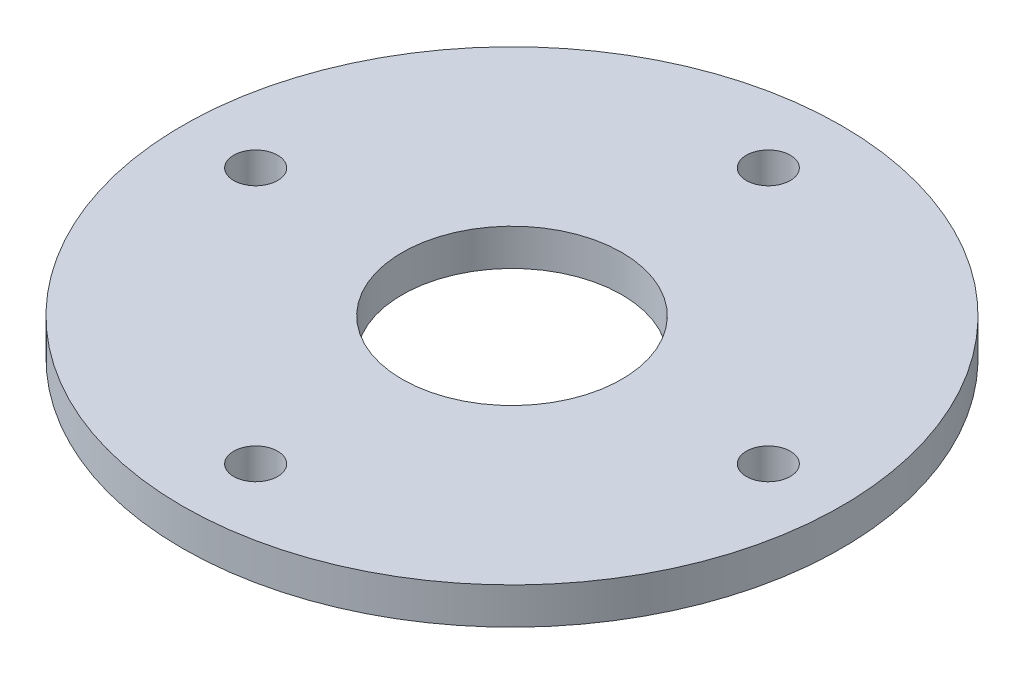
ISO-10303-21;
HEADER;
FILE_DESCRIPTION(('STEP AP214'),'2;1');
FILE_NAME('part.step','',(''),(''),'','','');
FILE_SCHEMA(('AUTOMOTIVE_DESIGN { 1 0 10303 214 1 1 1 1 }'));
ENDSEC;
DATA;
#1=APPLICATION_CONTEXT('core data for automotive mechanical design processes');
#2=APPLICATION_PROTOCOL_DEFINITION('international standard','automotive_design',2000,#1);
#3=PRODUCT_CONTEXT('',#1,'mechanical');
#4=PRODUCT('Part','Part','',(#3));
#5=PRODUCT_RELATED_PRODUCT_CATEGORY('part','',(#4));
#6=PRODUCT_DEFINITION_FORMATION('','',#4);
#7=PRODUCT_DEFINITION_CONTEXT('part definition',#1,'design');
#8=PRODUCT_DEFINITION('design','',#6,#7);
#9=PRODUCT_DEFINITION_SHAPE('','',#8);
#10=(LENGTH_UNIT() NAMED_UNIT(*) SI_UNIT(.MILLI.,.METRE.));
#11=(NAMED_UNIT(*) PLANE_ANGLE_UNIT() SI_UNIT($,.RADIAN.));
#12=(NAMED_UNIT(*) SI_UNIT($,.STERADIAN.) SOLID_ANGLE_UNIT());
#13=UNCERTAINTY_MEASURE_WITH_UNIT(LENGTH_MEASURE(1.E-05),#10,'distance_accuracy_value','');
#14=(GEOMETRIC_REPRESENTATION_CONTEXT(3) GLOBAL_UNCERTAINTY_ASSIGNED_CONTEXT((#13)) GLOBAL_UNIT_ASSIGNED_CONTEXT((#10,
#11,#12)) REPRESENTATION_CONTEXT('',''));
#15=CARTESIAN_POINT('',(0.,0.,0.));
#16=DIRECTION('',(0.,0.,1.));
#17=DIRECTION('',(1.,0.,0.));
#18=AXIS2_PLACEMENT_3D('',#15,#16,#17);
#19=CARTESIAN_POINT('',(0.,5.,0.));
#20=DIRECTION('',(0.,-1.,0.));
#21=DIRECTION('',(0.,0.,-1.));
#22=AXIS2_PLACEMENT_3D('',#19,#20,#21);
#23=CYLINDRICAL_SURFACE('',#22,15.);
#24=CARTESIAN_POINT('',(0.,5.,0.));
#25=DIRECTION('',(0.,1.,0.));
#26=DIRECTION('',(0.,0.,1.));
#27=AXIS2_PLACEMENT_3D('',#24,#25,#26);
#28=CIRCLE('',#27,15.);
#29=CARTESIAN_POINT('',(0.,5.,15.));
#30=VERTEX_POINT('',#29);
#31=EDGE_CURVE('E43',#30,#30,#28,.T.);
#32=ORIENTED_EDGE('',*,*,#31,.T.);
#33=EDGE_LOOP('',(#32));
#34=FACE_BOUND('',#33,.T.);
#35=CARTESIAN_POINT('',(0.,0.,0.));
#36=DIRECTION('',(0.,1.,0.));
#37=DIRECTION('',(0.,0.,1.));
#38=AXIS2_PLACEMENT_3D('',#35,#36,#37);
#39=CIRCLE('',#38,15.);
#40=CARTESIAN_POINT('',(0.,0.,15.));
#41=VERTEX_POINT('',#40);
#42=EDGE_CURVE('E63',#41,#41,#39,.T.);
#43=ORIENTED_EDGE('',*,*,#42,.F.);
#44=EDGE_LOOP('',(#43));
#45=FACE_BOUND('',#44,.T.);
#46=ADVANCED_FACE('F35',(#34,#45),#23,.F.);
#47=CARTESIAN_POINT('',(0.,5.,-35.));
#48=DIRECTION('',(0.,-1.,0.));
#49=DIRECTION('',(0.,0.,-1.));
#50=AXIS2_PLACEMENT_3D('',#47,#48,#49);
#51=CYLINDRICAL_SURFACE('',#50,3.);
#52=CARTESIAN_POINT('',(0.,5.,-35.));
#53=DIRECTION('',(0.,1.,0.));
#54=DIRECTION('',(0.,0.,1.));
#55=AXIS2_PLACEMENT_3D('',#52,#53,#54);
#56=CIRCLE('',#55,3.);
#57=CARTESIAN_POINT('',(0.,5.,-32.));
#58=VERTEX_POINT('',#57);
#59=EDGE_CURVE('E48',#58,#58,#56,.T.);
#60=ORIENTED_EDGE('',*,*,#59,.T.);
#61=EDGE_LOOP('',(#60));
#62=FACE_BOUND('',#61,.T.);
#63=CARTESIAN_POINT('',(0.,0.,-35.));
#64=DIRECTION('',(0.,1.,0.));
#65=DIRECTION('',(0.,0.,1.));
#66=AXIS2_PLACEMENT_3D('',#63,#64,#65);
#67=CIRCLE('',#66,3.);
#68=CARTESIAN_POINT('',(0.,0.,-32.));
#69=VERTEX_POINT('',#68);
#70=EDGE_CURVE('E61',#69,#69,#67,.T.);
#71=ORIENTED_EDGE('',*,*,#70,.F.);
#72=EDGE_LOOP('',(#71));
#73=FACE_BOUND('',#72,.T.);
#74=ADVANCED_FACE('F84',(#62,#73),#51,.F.);
#75=CARTESIAN_POINT('',(0.,5.,35.));
#76=DIRECTION('',(0.,-1.,0.));
#77=DIRECTION('',(0.,0.,-1.));
#78=AXIS2_PLACEMENT_3D('',#75,#76,#77);
#79=CYLINDRICAL_SURFACE('',#78,3.);
#80=CARTESIAN_POINT('',(0.,5.,35.));
#81=DIRECTION('',(0.,1.,0.));
#82=DIRECTION('',(0.,0.,1.));
#83=AXIS2_PLACEMENT_3D('',#80,#81,#82);
#84=CIRCLE('',#83,3.);
#85=CARTESIAN_POINT('',(0.,5.,38.));
#86=VERTEX_POINT('',#85);
#87=EDGE_CURVE('E77',#86,#86,#84,.T.);
#88=ORIENTED_EDGE('',*,*,#87,.T.);
#89=EDGE_LOOP('',(#88));
#90=FACE_BOUND('',#89,.T.);
#91=CARTESIAN_POINT('',(0.,0.,35.));
#92=DIRECTION('',(0.,1.,0.));
#93=DIRECTION('',(0.,0.,1.));
#94=AXIS2_PLACEMENT_3D('',#91,#92,#93);
#95=CIRCLE('',#94,3.);
#96=CARTESIAN_POINT('',(0.,0.,38.));
#97=VERTEX_POINT('',#96);
#98=EDGE_CURVE('E58',#97,#97,#95,.T.);
#99=ORIENTED_EDGE('',*,*,#98,.F.);
#100=EDGE_LOOP('',(#99));
#101=FACE_BOUND('',#100,.T.);
#102=ADVANCED_FACE('F102',(#90,#101),#79,.F.);
#103=CARTESIAN_POINT('',(35.,5.,0.));
#104=DIRECTION('',(0.,-1.,0.));
#105=DIRECTION('',(0.,0.,-1.));
#106=AXIS2_PLACEMENT_3D('',#103,#104,#105);
#107=CYLINDRICAL_SURFACE('',#106,3.);
#108=CARTESIAN_POINT('',(35.,5.,0.));
#109=DIRECTION('',(0.,1.,0.));
#110=DIRECTION('',(0.,0.,1.));
#111=AXIS2_PLACEMENT_3D('',#108,#109,#110);
#112=CIRCLE('',#111,3.);
#113=CARTESIAN_POINT('',(35.,5.,3.));
#114=VERTEX_POINT('',#113);
#115=EDGE_CURVE('E72',#114,#114,#112,.T.);
#116=ORIENTED_EDGE('',*,*,#115,.T.);
#117=EDGE_LOOP('',(#116));
#118=FACE_BOUND('',#117,.T.);
#119=CARTESIAN_POINT('',(35.,0.,0.));
#120=DIRECTION('',(0.,1.,0.));
#121=DIRECTION('',(0.,0.,1.));
#122=AXIS2_PLACEMENT_3D('',#119,#120,#121);
#123=CIRCLE('',#122,3.);
#124=CARTESIAN_POINT('',(35.,0.,3.));
#125=VERTEX_POINT('',#124);
#126=EDGE_CURVE('E55',#125,#125,#123,.T.);
#127=ORIENTED_EDGE('',*,*,#126,.F.);
#128=EDGE_LOOP('',(#127));
#129=FACE_BOUND('',#128,.T.);
#130=ADVANCED_FACE('F108',(#118,#129),#107,.F.);
#131=CARTESIAN_POINT('',(-35.,5.,0.));
#132=DIRECTION('',(0.,-1.,0.));
#133=DIRECTION('',(0.,0.,-1.));
#134=AXIS2_PLACEMENT_3D('',#131,#132,#133);
#135=CYLINDRICAL_SURFACE('',#134,3.);
#136=CARTESIAN_POINT('',(-35.,5.,0.));
#137=DIRECTION('',(0.,1.,0.));
#138=DIRECTION('',(0.,0.,1.));
#139=AXIS2_PLACEMENT_3D('',#136,#137,#138);
#140=CIRCLE('',#139,3.);
#141=CARTESIAN_POINT('',(-35.,5.,3.00000000000002));
#142=VERTEX_POINT('',#141);
#143=EDGE_CURVE('E68',#142,#142,#140,.T.);
#144=ORIENTED_EDGE('',*,*,#143,.T.);
#145=EDGE_LOOP('',(#144));
#146=FACE_BOUND('',#145,.T.);
#147=CARTESIAN_POINT('',(-35.,0.,0.));
#148=DIRECTION('',(0.,1.,0.));
#149=DIRECTION('',(0.,0.,1.));
#150=AXIS2_PLACEMENT_3D('',#147,#148,#149);
#151=CIRCLE('',#150,3.);
#152=CARTESIAN_POINT('',(-35.,0.,3.00000000000002));
#153=VERTEX_POINT('',#152);
#154=EDGE_CURVE('E52',#153,#153,#151,.T.);
#155=ORIENTED_EDGE('',*,*,#154,.F.);
#156=EDGE_LOOP('',(#155));
#157=FACE_BOUND('',#156,.T.);
#158=ADVANCED_FACE('F37',(#146,#157),#135,.F.);
#159=CARTESIAN_POINT('',(0.,5.,0.));
#160=DIRECTION('',(0.,-1.,0.));
#161=DIRECTION('',(0.,0.,-1.));
#162=AXIS2_PLACEMENT_3D('',#159,#160,#161);
#163=CYLINDRICAL_SURFACE('',#162,45.);
#164=CARTESIAN_POINT('',(0.,5.,0.));
#165=DIRECTION('',(0.,1.,0.));
#166=DIRECTION('',(0.,0.,1.));
#167=AXIS2_PLACEMENT_3D('',#164,#165,#166);
#168=CIRCLE('',#167,45.);
#169=CARTESIAN_POINT('',(0.,5.,45.));
#170=VERTEX_POINT('',#169);
#171=EDGE_CURVE('E10',#170,#170,#168,.T.);
#172=ORIENTED_EDGE('',*,*,#171,.F.);
#173=EDGE_LOOP('',(#172));
#174=FACE_BOUND('',#173,.T.);
#175=CARTESIAN_POINT('',(0.,0.,0.));
#176=DIRECTION('',(0.,1.,0.));
#177=DIRECTION('',(0.,0.,1.));
#178=AXIS2_PLACEMENT_3D('',#175,#176,#177);
#179=CIRCLE('',#178,45.);
#180=CARTESIAN_POINT('',(0.,0.,45.));
#181=VERTEX_POINT('',#180);
#182=EDGE_CURVE('E39',#181,#181,#179,.T.);
#183=ORIENTED_EDGE('',*,*,#182,.T.);
#184=EDGE_LOOP('',(#183));
#185=FACE_BOUND('',#184,.T.);
#186=ADVANCED_FACE('F91',(#174,#185),#163,.T.);
#187=CARTESIAN_POINT('',(0.,5.,0.));
#188=DIRECTION('',(0.,1.,0.));
#189=DIRECTION('',(0.,0.,1.));
#190=AXIS2_PLACEMENT_3D('',#187,#188,#189);
#191=PLANE('',#190);
#192=ORIENTED_EDGE('',*,*,#143,.F.);
#193=EDGE_LOOP('',(#192));
#194=FACE_BOUND('',#193,.T.);
#195=ORIENTED_EDGE('',*,*,#115,.F.);
#196=EDGE_LOOP('',(#195));
#197=FACE_BOUND('',#196,.T.);
#198=ORIENTED_EDGE('',*,*,#87,.F.);
#199=EDGE_LOOP('',(#198));
#200=FACE_BOUND('',#199,.T.);
#201=ORIENTED_EDGE('',*,*,#59,.F.);
#202=EDGE_LOOP('',(#201));
#203=FACE_BOUND('',#202,.T.);
#204=ORIENTED_EDGE('',*,*,#31,.F.);
#205=EDGE_LOOP('',(#204));
#206=FACE_BOUND('',#205,.T.);
#207=ORIENTED_EDGE('',*,*,#171,.T.);
#208=EDGE_LOOP('',(#207));
#209=FACE_BOUND('',#208,.T.);
#210=ADVANCED_FACE('F87',(#194,#197,#200,#203,#206,#209),#191,.T.);
#211=CARTESIAN_POINT('',(0.,0.,0.));
#212=DIRECTION('',(0.,1.,0.));
#213=DIRECTION('',(0.,0.,1.));
#214=AXIS2_PLACEMENT_3D('',#211,#212,#213);
#215=PLANE('',#214);
#216=ORIENTED_EDGE('',*,*,#154,.T.);
#217=EDGE_LOOP('',(#216));
#218=FACE_BOUND('',#217,.T.);
#219=ORIENTED_EDGE('',*,*,#126,.T.);
#220=EDGE_LOOP('',(#219));
#221=FACE_BOUND('',#220,.T.);
#222=ORIENTED_EDGE('',*,*,#98,.T.);
#223=EDGE_LOOP('',(#222));
#224=FACE_BOUND('',#223,.T.);
#225=ORIENTED_EDGE('',*,*,#70,.T.);
#226=EDGE_LOOP('',(#225));
#227=FACE_BOUND('',#226,.T.);
#228=ORIENTED_EDGE('',*,*,#42,.T.);
#229=EDGE_LOOP('',(#228));
#230=FACE_BOUND('',#229,.T.);
#231=ORIENTED_EDGE('',*,*,#182,.F.);
#232=EDGE_LOOP('',(#231));
#233=FACE_BOUND('',#232,.T.);
#234=ADVANCED_FACE('F90',(#218,#221,#224,#227,#230,#233),#215,.F.);
#235=CLOSED_SHELL('',(#46,#74,#102,#130,#158,#186,#210,#234));
#236=MANIFOLD_SOLID_BREP('B2',#235);
#237=ADVANCED_BREP_SHAPE_REPRESENTATION('',(#18,#236),#14);
#238=SHAPE_DEFINITION_REPRESENTATION(#9,#237);
ENDSEC;
END-ISO-10303-21;
